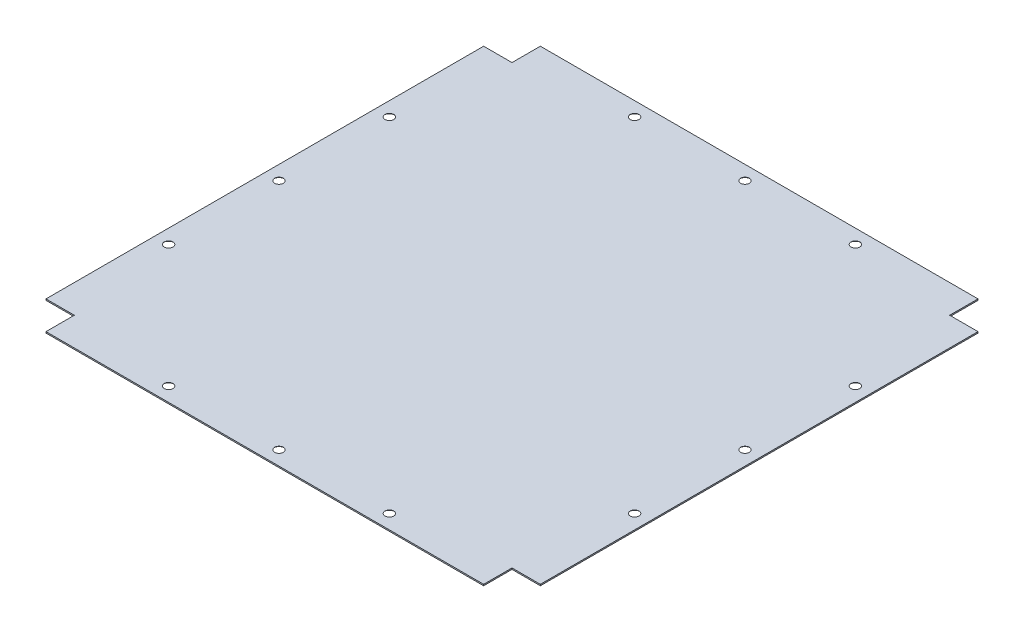
ISO-10303-21;
HEADER;
FILE_DESCRIPTION(('STEP AP214'),'2;1');
FILE_NAME('part.step','',(''),(''),'','','');
FILE_SCHEMA(('AUTOMOTIVE_DESIGN { 1 0 10303 214 1 1 1 1 }'));
ENDSEC;
DATA;
#1=APPLICATION_CONTEXT('core data for automotive mechanical design processes');
#2=APPLICATION_PROTOCOL_DEFINITION('international standard','automotive_design',2000,#1);
#3=PRODUCT_CONTEXT('',#1,'mechanical');
#4=PRODUCT('Part','Part','',(#3));
#5=PRODUCT_RELATED_PRODUCT_CATEGORY('part','',(#4));
#6=PRODUCT_DEFINITION_FORMATION('','',#4);
#7=PRODUCT_DEFINITION_CONTEXT('part definition',#1,'design');
#8=PRODUCT_DEFINITION('design','',#6,#7);
#9=PRODUCT_DEFINITION_SHAPE('','',#8);
#10=(LENGTH_UNIT() NAMED_UNIT(*) SI_UNIT(.MILLI.,.METRE.));
#11=(NAMED_UNIT(*) PLANE_ANGLE_UNIT() SI_UNIT($,.RADIAN.));
#12=(NAMED_UNIT(*) SI_UNIT($,.STERADIAN.) SOLID_ANGLE_UNIT());
#13=UNCERTAINTY_MEASURE_WITH_UNIT(LENGTH_MEASURE(1.E-05),#10,'distance_accuracy_value','');
#14=(GEOMETRIC_REPRESENTATION_CONTEXT(3) GLOBAL_UNCERTAINTY_ASSIGNED_CONTEXT((#13)) GLOBAL_UNIT_ASSIGNED_CONTEXT((#10,
#11,#12)) REPRESENTATION_CONTEXT('',''));
#15=CARTESIAN_POINT('',(0.,0.,0.));
#16=DIRECTION('',(0.,0.,1.));
#17=DIRECTION('',(1.,0.,0.));
#18=AXIS2_PLACEMENT_3D('',#15,#16,#17);
#19=CARTESIAN_POINT('',(0.,0.,0.));
#20=DIRECTION('',(0.,1.,0.));
#21=DIRECTION('',(0.,0.,1.));
#22=AXIS2_PLACEMENT_3D('',#19,#20,#21);
#23=PLANE('',#22);
#24=CARTESIAN_POINT('',(374.999999999896,0.,21.5000000000088));
#25=DIRECTION('',(0.,-1.,0.));
#26=DIRECTION('',(0.,0.,-1.));
#27=AXIS2_PLACEMENT_3D('',#24,#25,#26);
#28=CIRCLE('',#27,8.64999999999999);
#29=CARTESIAN_POINT('',(374.999999999896,0.,12.8500000000089));
#30=VERTEX_POINT('',#29);
#31=EDGE_CURVE('E564',#30,#30,#28,.T.);
#32=ORIENTED_EDGE('',*,*,#31,.F.);
#33=EDGE_LOOP('',(#32));
#34=FACE_BOUND('',#33,.T.);
#35=CARTESIAN_POINT('',(728.499999999982,0.,207.5));
#36=DIRECTION('',(0.,-1.,0.));
#37=DIRECTION('',(0.,0.,-1.));
#38=AXIS2_PLACEMENT_3D('',#35,#36,#37);
#39=CIRCLE('',#38,8.65000000000005);
#40=CARTESIAN_POINT('',(728.499999999982,0.,198.85));
#41=VERTEX_POINT('',#40);
#42=EDGE_CURVE('E226',#41,#41,#39,.T.);
#43=ORIENTED_EDGE('',*,*,#42,.F.);
#44=EDGE_LOOP('',(#43));
#45=FACE_BOUND('',#44,.T.);
#46=CARTESIAN_POINT('',(728.499999999982,0.,375.));
#47=DIRECTION('',(0.,-1.,0.));
#48=DIRECTION('',(0.,0.,-1.));
#49=AXIS2_PLACEMENT_3D('',#46,#47,#48);
#50=CIRCLE('',#49,8.65000000000005);
#51=CARTESIAN_POINT('',(728.499999999982,0.,366.35));
#52=VERTEX_POINT('',#51);
#53=EDGE_CURVE('E232',#52,#52,#50,.T.);
#54=ORIENTED_EDGE('',*,*,#53,.F.);
#55=EDGE_LOOP('',(#54));
#56=FACE_BOUND('',#55,.T.);
#57=CARTESIAN_POINT('',(374.999999999896,0.,728.499999999991));
#58=DIRECTION('',(0.,-1.,0.));
#59=DIRECTION('',(0.,0.,-1.));
#60=AXIS2_PLACEMENT_3D('',#57,#58,#59);
#61=CIRCLE('',#60,8.64999999999999);
#62=CARTESIAN_POINT('',(374.999999999896,0.,719.849999999991));
#63=VERTEX_POINT('',#62);
#64=EDGE_CURVE('E238',#63,#63,#61,.T.);
#65=ORIENTED_EDGE('',*,*,#64,.F.);
#66=EDGE_LOOP('',(#65));
#67=FACE_BOUND('',#66,.T.);
#68=CARTESIAN_POINT('',(542.499999999896,0.,728.499999999991));
#69=DIRECTION('',(0.,-1.,0.));
#70=DIRECTION('',(0.,0.,-1.));
#71=AXIS2_PLACEMENT_3D('',#68,#69,#70);
#72=CIRCLE('',#71,8.65000000000005);
#73=CARTESIAN_POINT('',(542.499999999896,0.,719.849999999991));
#74=VERTEX_POINT('',#73);
#75=EDGE_CURVE('E244',#74,#74,#72,.T.);
#76=ORIENTED_EDGE('',*,*,#75,.F.);
#77=EDGE_LOOP('',(#76));
#78=FACE_BOUND('',#77,.T.);
#79=CARTESIAN_POINT('',(207.499999999896,0.,728.499999999991));
#80=DIRECTION('',(0.,-1.,0.));
#81=DIRECTION('',(0.,0.,-1.));
#82=AXIS2_PLACEMENT_3D('',#79,#80,#81);
#83=CIRCLE('',#82,8.64999999999999);
#84=CARTESIAN_POINT('',(207.499999999896,0.,719.849999999991));
#85=VERTEX_POINT('',#84);
#86=EDGE_CURVE('E250',#85,#85,#83,.T.);
#87=ORIENTED_EDGE('',*,*,#86,.F.);
#88=EDGE_LOOP('',(#87));
#89=FACE_BOUND('',#88,.T.);
#90=CARTESIAN_POINT('',(21.5000000000184,0.,542.5));
#91=DIRECTION('',(0.,-1.,0.));
#92=DIRECTION('',(0.,0.,-1.));
#93=AXIS2_PLACEMENT_3D('',#90,#91,#92);
#94=CIRCLE('',#93,8.65);
#95=CARTESIAN_POINT('',(21.5000000000184,0.,533.85));
#96=VERTEX_POINT('',#95);
#97=EDGE_CURVE('E256',#96,#96,#94,.T.);
#98=ORIENTED_EDGE('',*,*,#97,.F.);
#99=EDGE_LOOP('',(#98));
#100=FACE_BOUND('',#99,.T.);
#101=CARTESIAN_POINT('',(21.5000000000184,0.,207.5));
#102=DIRECTION('',(0.,-1.,0.));
#103=DIRECTION('',(0.,0.,-1.));
#104=AXIS2_PLACEMENT_3D('',#101,#102,#103);
#105=CIRCLE('',#104,8.65);
#106=CARTESIAN_POINT('',(21.5000000000184,0.,198.85));
#107=VERTEX_POINT('',#106);
#108=EDGE_CURVE('E262',#107,#107,#105,.T.);
#109=ORIENTED_EDGE('',*,*,#108,.F.);
#110=EDGE_LOOP('',(#109));
#111=FACE_BOUND('',#110,.T.);
#112=CARTESIAN_POINT('',(21.5000000000184,0.,375.));
#113=DIRECTION('',(0.,-1.,0.));
#114=DIRECTION('',(0.,0.,-1.));
#115=AXIS2_PLACEMENT_3D('',#112,#113,#114);
#116=CIRCLE('',#115,8.65);
#117=CARTESIAN_POINT('',(21.5000000000184,0.,366.35));
#118=VERTEX_POINT('',#117);
#119=EDGE_CURVE('E268',#118,#118,#116,.T.);
#120=ORIENTED_EDGE('',*,*,#119,.F.);
#121=EDGE_LOOP('',(#120));
#122=FACE_BOUND('',#121,.T.);
#123=DIRECTION('',(0.,0.,-1.));
#124=VECTOR('',#123,1.);
#125=CARTESIAN_POINT('',(43.0000000000366,0.,0.));
#126=LINE('',#125,#124);
#127=CARTESIAN_POINT('',(43.0000000000369,0.,750.));
#128=VERTEX_POINT('',#127);
#129=CARTESIAN_POINT('',(43.0000000000368,0.,707.000000000001));
#130=VERTEX_POINT('',#129);
#131=EDGE_CURVE('E158',#128,#130,#126,.T.);
#132=ORIENTED_EDGE('',*,*,#131,.T.);
#133=DIRECTION('',(1.,0.,0.));
#134=VECTOR('',#133,1.);
#135=CARTESIAN_POINT('',(0.,0.,707.000000000001));
#136=LINE('',#135,#134);
#137=CARTESIAN_POINT('',(0.,0.,707.000000000001));
#138=VERTEX_POINT('',#137);
#139=EDGE_CURVE('E187',#138,#130,#136,.T.);
#140=ORIENTED_EDGE('',*,*,#139,.F.);
#141=DIRECTION('',(0.,0.,1.));
#142=VECTOR('',#141,1.);
#143=CARTESIAN_POINT('',(0.,0.,0.));
#144=LINE('',#143,#142);
#145=CARTESIAN_POINT('',(0.,0.,43.));
#146=VERTEX_POINT('',#145);
#147=EDGE_CURVE('E93',#146,#138,#144,.T.);
#148=ORIENTED_EDGE('',*,*,#147,.F.);
#149=DIRECTION('',(1.,0.,0.));
#150=VECTOR('',#149,1.);
#151=CARTESIAN_POINT('',(0.,0.,43.));
#152=LINE('',#151,#150);
#153=CARTESIAN_POINT('',(43.,0.,43.));
#154=VERTEX_POINT('',#153);
#155=EDGE_CURVE('E139',#146,#154,#152,.T.);
#156=ORIENTED_EDGE('',*,*,#155,.T.);
#157=DIRECTION('',(0.,0.,1.));
#158=VECTOR('',#157,1.);
#159=CARTESIAN_POINT('',(43.,0.,0.));
#160=LINE('',#159,#158);
#161=CARTESIAN_POINT('',(43.,0.,0.));
#162=VERTEX_POINT('',#161);
#163=EDGE_CURVE('E182',#162,#154,#160,.T.);
#164=ORIENTED_EDGE('',*,*,#163,.F.);
#165=DIRECTION('',(1.,0.,0.));
#166=VECTOR('',#165,1.);
#167=CARTESIAN_POINT('',(0.,0.,0.));
#168=LINE('',#167,#166);
#169=CARTESIAN_POINT('',(707.000000000001,0.,0.));
#170=VERTEX_POINT('',#169);
#171=EDGE_CURVE('E179',#162,#170,#168,.T.);
#172=ORIENTED_EDGE('',*,*,#171,.T.);
#173=DIRECTION('',(0.,0.,1.));
#174=VECTOR('',#173,1.);
#175=CARTESIAN_POINT('',(707.000000000001,0.,-1.82541320560462E-12));
#176=LINE('',#175,#174);
#177=CARTESIAN_POINT('',(707.000000000001,0.,42.9999999999633));
#178=VERTEX_POINT('',#177);
#179=EDGE_CURVE('E176',#170,#178,#176,.T.);
#180=ORIENTED_EDGE('',*,*,#179,.T.);
#181=DIRECTION('',(-1.,0.,0.));
#182=VECTOR('',#181,1.);
#183=CARTESIAN_POINT('',(0.,0.,42.9999999999642));
#184=LINE('',#183,#182);
#185=CARTESIAN_POINT('',(750.000000000001,0.,42.9999999999632));
#186=VERTEX_POINT('',#185);
#187=EDGE_CURVE('E173',#186,#178,#184,.T.);
#188=ORIENTED_EDGE('',*,*,#187,.F.);
#189=DIRECTION('',(0.,0.,1.));
#190=VECTOR('',#189,1.);
#191=CARTESIAN_POINT('',(750.,0.,0.));
#192=LINE('',#191,#190);
#193=CARTESIAN_POINT('',(750.,0.,706.999999999964));
#194=VERTEX_POINT('',#193);
#195=EDGE_CURVE('E170',#186,#194,#192,.T.);
#196=ORIENTED_EDGE('',*,*,#195,.T.);
#197=DIRECTION('',(-1.,0.,0.));
#198=VECTOR('',#197,1.);
#199=CARTESIAN_POINT('',(0.,0.,706.999999999964));
#200=LINE('',#199,#198);
#201=CARTESIAN_POINT('',(707.000000000038,0.,706.999999999964));
#202=VERTEX_POINT('',#201);
#203=EDGE_CURVE('E167',#194,#202,#200,.T.);
#204=ORIENTED_EDGE('',*,*,#203,.T.);
#205=DIRECTION('',(0.,0.,-1.));
#206=VECTOR('',#205,1.);
#207=CARTESIAN_POINT('',(707.000000000038,0.,0.));
#208=LINE('',#207,#206);
#209=CARTESIAN_POINT('',(707.000000000038,0.,750.));
#210=VERTEX_POINT('',#209);
#211=EDGE_CURVE('E164',#210,#202,#208,.T.);
#212=ORIENTED_EDGE('',*,*,#211,.F.);
#213=DIRECTION('',(1.,0.,0.));
#214=VECTOR('',#213,1.);
#215=CARTESIAN_POINT('',(0.,0.,750.));
#216=LINE('',#215,#214);
#217=EDGE_CURVE('E161',#128,#210,#216,.T.);
#218=ORIENTED_EDGE('',*,*,#217,.F.);
#219=EDGE_LOOP('',(#132,#140,#148,#156,#164,#172,#180,#188,#196,#204,#212,#218));
#220=FACE_BOUND('',#219,.T.);
#221=CARTESIAN_POINT('',(728.499999999982,0.,542.5));
#222=DIRECTION('',(0.,-1.,0.));
#223=DIRECTION('',(0.,0.,-1.));
#224=AXIS2_PLACEMENT_3D('',#221,#222,#223);
#225=CIRCLE('',#224,8.65000000000005);
#226=CARTESIAN_POINT('',(728.499999999982,0.,533.85));
#227=VERTEX_POINT('',#226);
#228=EDGE_CURVE('E208',#227,#227,#225,.T.);
#229=ORIENTED_EDGE('',*,*,#228,.F.);
#230=EDGE_LOOP('',(#229));
#231=FACE_BOUND('',#230,.T.);
#232=CARTESIAN_POINT('',(207.499999999896,0.,21.5000000000088));
#233=DIRECTION('',(0.,-1.,0.));
#234=DIRECTION('',(0.,0.,-1.));
#235=AXIS2_PLACEMENT_3D('',#232,#233,#234);
#236=CIRCLE('',#235,8.64999999999999);
#237=CARTESIAN_POINT('',(207.499999999896,0.,12.8500000000089));
#238=VERTEX_POINT('',#237);
#239=EDGE_CURVE('E209',#238,#238,#236,.T.);
#240=ORIENTED_EDGE('',*,*,#239,.F.);
#241=EDGE_LOOP('',(#240));
#242=FACE_BOUND('',#241,.T.);
#243=CARTESIAN_POINT('',(542.499999999896,0.,21.5000000000088));
#244=DIRECTION('',(0.,-1.,0.));
#245=DIRECTION('',(0.,0.,-1.));
#246=AXIS2_PLACEMENT_3D('',#243,#244,#245);
#247=CIRCLE('',#246,8.65000000000005);
#248=CARTESIAN_POINT('',(542.499999999896,0.,12.8500000000088));
#249=VERTEX_POINT('',#248);
#250=EDGE_CURVE('E220',#249,#249,#247,.T.);
#251=ORIENTED_EDGE('',*,*,#250,.F.);
#252=EDGE_LOOP('',(#251));
#253=FACE_BOUND('',#252,.T.);
#254=ADVANCED_FACE('F35',(#34,#45,#56,#67,#78,#89,#100,#111,#122,#220,#231,#242,#253),#23,.F.);
#255=CARTESIAN_POINT('',(0.,2.,0.));
#256=DIRECTION('',(0.,1.,0.));
#257=DIRECTION('',(0.,0.,1.));
#258=AXIS2_PLACEMENT_3D('',#255,#256,#257);
#259=PLANE('',#258);
#260=CARTESIAN_POINT('',(374.999999999896,2.,21.5000000000088));
#261=DIRECTION('',(0.,1.,0.));
#262=DIRECTION('',(0.,0.,1.));
#263=AXIS2_PLACEMENT_3D('',#260,#261,#262);
#264=CIRCLE('',#263,6.64999999999999);
#265=CARTESIAN_POINT('',(374.999999999896,2.,28.1500000000088));
#266=VERTEX_POINT('',#265);
#267=EDGE_CURVE('E562',#266,#266,#264,.T.);
#268=ORIENTED_EDGE('',*,*,#267,.F.);
#269=EDGE_LOOP('',(#268));
#270=FACE_BOUND('',#269,.T.);
#271=CARTESIAN_POINT('',(542.499999999896,2.,21.5000000000088));
#272=DIRECTION('',(0.,1.,0.));
#273=DIRECTION('',(0.,0.,1.));
#274=AXIS2_PLACEMENT_3D('',#271,#272,#273);
#275=CIRCLE('',#274,6.64999999999999);
#276=CARTESIAN_POINT('',(542.499999999896,2.,28.1500000000088));
#277=VERTEX_POINT('',#276);
#278=EDGE_CURVE('E39',#277,#277,#275,.T.);
#279=ORIENTED_EDGE('',*,*,#278,.F.);
#280=EDGE_LOOP('',(#279));
#281=FACE_BOUND('',#280,.T.);
#282=CARTESIAN_POINT('',(728.499999999982,2.,542.5));
#283=DIRECTION('',(0.,1.,0.));
#284=DIRECTION('',(0.,0.,1.));
#285=AXIS2_PLACEMENT_3D('',#282,#283,#284);
#286=CIRCLE('',#285,6.64999999999999);
#287=CARTESIAN_POINT('',(728.499999999982,2.,549.15));
#288=VERTEX_POINT('',#287);
#289=EDGE_CURVE('E213',#288,#288,#286,.T.);
#290=ORIENTED_EDGE('',*,*,#289,.F.);
#291=EDGE_LOOP('',(#290));
#292=FACE_BOUND('',#291,.T.);
#293=CARTESIAN_POINT('',(728.499999999982,2.,207.5));
#294=DIRECTION('',(0.,1.,0.));
#295=DIRECTION('',(0.,0.,1.));
#296=AXIS2_PLACEMENT_3D('',#293,#294,#295);
#297=CIRCLE('',#296,6.64999999999999);
#298=CARTESIAN_POINT('',(728.499999999982,2.,214.15));
#299=VERTEX_POINT('',#298);
#300=EDGE_CURVE('E229',#299,#299,#297,.T.);
#301=ORIENTED_EDGE('',*,*,#300,.F.);
#302=EDGE_LOOP('',(#301));
#303=FACE_BOUND('',#302,.T.);
#304=CARTESIAN_POINT('',(728.499999999982,2.,375.));
#305=DIRECTION('',(0.,1.,0.));
#306=DIRECTION('',(0.,0.,1.));
#307=AXIS2_PLACEMENT_3D('',#304,#305,#306);
#308=CIRCLE('',#307,6.64999999999999);
#309=CARTESIAN_POINT('',(728.499999999982,2.,381.65));
#310=VERTEX_POINT('',#309);
#311=EDGE_CURVE('E235',#310,#310,#308,.T.);
#312=ORIENTED_EDGE('',*,*,#311,.F.);
#313=EDGE_LOOP('',(#312));
#314=FACE_BOUND('',#313,.T.);
#315=CARTESIAN_POINT('',(374.999999999896,2.,728.499999999991));
#316=DIRECTION('',(0.,1.,0.));
#317=DIRECTION('',(0.,0.,1.));
#318=AXIS2_PLACEMENT_3D('',#315,#316,#317);
#319=CIRCLE('',#318,6.64999999999999);
#320=CARTESIAN_POINT('',(374.999999999896,2.,735.149999999991));
#321=VERTEX_POINT('',#320);
#322=EDGE_CURVE('E241',#321,#321,#319,.T.);
#323=ORIENTED_EDGE('',*,*,#322,.F.);
#324=EDGE_LOOP('',(#323));
#325=FACE_BOUND('',#324,.T.);
#326=CARTESIAN_POINT('',(542.499999999896,2.,728.499999999991));
#327=DIRECTION('',(0.,1.,0.));
#328=DIRECTION('',(0.,0.,1.));
#329=AXIS2_PLACEMENT_3D('',#326,#327,#328);
#330=CIRCLE('',#329,6.64999999999999);
#331=CARTESIAN_POINT('',(542.499999999896,2.,735.149999999991));
#332=VERTEX_POINT('',#331);
#333=EDGE_CURVE('E247',#332,#332,#330,.T.);
#334=ORIENTED_EDGE('',*,*,#333,.F.);
#335=EDGE_LOOP('',(#334));
#336=FACE_BOUND('',#335,.T.);
#337=CARTESIAN_POINT('',(207.499999999896,2.,728.499999999991));
#338=DIRECTION('',(0.,1.,0.));
#339=DIRECTION('',(0.,0.,1.));
#340=AXIS2_PLACEMENT_3D('',#337,#338,#339);
#341=CIRCLE('',#340,6.64999999999998);
#342=CARTESIAN_POINT('',(207.499999999896,2.,735.149999999991));
#343=VERTEX_POINT('',#342);
#344=EDGE_CURVE('E253',#343,#343,#341,.T.);
#345=ORIENTED_EDGE('',*,*,#344,.F.);
#346=EDGE_LOOP('',(#345));
#347=FACE_BOUND('',#346,.T.);
#348=CARTESIAN_POINT('',(21.5000000000184,2.,542.5));
#349=DIRECTION('',(0.,1.,0.));
#350=DIRECTION('',(0.,0.,1.));
#351=AXIS2_PLACEMENT_3D('',#348,#349,#350);
#352=CIRCLE('',#351,6.64999999999999);
#353=CARTESIAN_POINT('',(21.5000000000184,2.,549.15));
#354=VERTEX_POINT('',#353);
#355=EDGE_CURVE('E259',#354,#354,#352,.T.);
#356=ORIENTED_EDGE('',*,*,#355,.F.);
#357=EDGE_LOOP('',(#356));
#358=FACE_BOUND('',#357,.T.);
#359=CARTESIAN_POINT('',(21.5000000000184,2.,207.5));
#360=DIRECTION('',(0.,1.,0.));
#361=DIRECTION('',(0.,0.,1.));
#362=AXIS2_PLACEMENT_3D('',#359,#360,#361);
#363=CIRCLE('',#362,6.64999999999999);
#364=CARTESIAN_POINT('',(21.5000000000184,2.,214.15));
#365=VERTEX_POINT('',#364);
#366=EDGE_CURVE('E265',#365,#365,#363,.T.);
#367=ORIENTED_EDGE('',*,*,#366,.F.);
#368=EDGE_LOOP('',(#367));
#369=FACE_BOUND('',#368,.T.);
#370=DIRECTION('',(0.,0.,-1.));
#371=VECTOR('',#370,1.);
#372=CARTESIAN_POINT('',(43.0000000000366,2.,0.));
#373=LINE('',#372,#371);
#374=CARTESIAN_POINT('',(43.0000000000369,2.,750.));
#375=VERTEX_POINT('',#374);
#376=CARTESIAN_POINT('',(43.0000000000368,2.,707.000000000001));
#377=VERTEX_POINT('',#376);
#378=EDGE_CURVE('E189',#375,#377,#373,.T.);
#379=ORIENTED_EDGE('',*,*,#378,.F.);
#380=DIRECTION('',(1.,0.,0.));
#381=VECTOR('',#380,1.);
#382=CARTESIAN_POINT('',(0.,2.,750.));
#383=LINE('',#382,#381);
#384=CARTESIAN_POINT('',(707.000000000038,2.,750.));
#385=VERTEX_POINT('',#384);
#386=EDGE_CURVE('E274',#375,#385,#383,.T.);
#387=ORIENTED_EDGE('',*,*,#386,.T.);
#388=DIRECTION('',(0.,0.,-1.));
#389=VECTOR('',#388,1.);
#390=CARTESIAN_POINT('',(707.000000000038,2.,0.));
#391=LINE('',#390,#389);
#392=CARTESIAN_POINT('',(707.000000000038,2.,706.999999999964));
#393=VERTEX_POINT('',#392);
#394=EDGE_CURVE('E276',#385,#393,#391,.T.);
#395=ORIENTED_EDGE('',*,*,#394,.T.);
#396=DIRECTION('',(-1.,0.,0.));
#397=VECTOR('',#396,1.);
#398=CARTESIAN_POINT('',(0.,2.,706.999999999964));
#399=LINE('',#398,#397);
#400=CARTESIAN_POINT('',(750.,2.,706.999999999964));
#401=VERTEX_POINT('',#400);
#402=EDGE_CURVE('E278',#401,#393,#399,.T.);
#403=ORIENTED_EDGE('',*,*,#402,.F.);
#404=DIRECTION('',(0.,0.,1.));
#405=VECTOR('',#404,1.);
#406=CARTESIAN_POINT('',(750.,2.,0.));
#407=LINE('',#406,#405);
#408=CARTESIAN_POINT('',(750.000000000001,2.,42.9999999999632));
#409=VERTEX_POINT('',#408);
#410=EDGE_CURVE('E281',#409,#401,#407,.T.);
#411=ORIENTED_EDGE('',*,*,#410,.F.);
#412=DIRECTION('',(-1.,0.,0.));
#413=VECTOR('',#412,1.);
#414=CARTESIAN_POINT('',(0.,2.,42.9999999999642));
#415=LINE('',#414,#413);
#416=CARTESIAN_POINT('',(707.000000000001,2.,42.9999999999633));
#417=VERTEX_POINT('',#416);
#418=EDGE_CURVE('E284',#409,#417,#415,.T.);
#419=ORIENTED_EDGE('',*,*,#418,.T.);
#420=DIRECTION('',(0.,0.,1.));
#421=VECTOR('',#420,1.);
#422=CARTESIAN_POINT('',(707.000000000001,2.,-1.82541320560462E-12));
#423=LINE('',#422,#421);
#424=CARTESIAN_POINT('',(707.000000000001,2.,0.));
#425=VERTEX_POINT('',#424);
#426=EDGE_CURVE('E286',#425,#417,#423,.T.);
#427=ORIENTED_EDGE('',*,*,#426,.F.);
#428=DIRECTION('',(1.,0.,0.));
#429=VECTOR('',#428,1.);
#430=CARTESIAN_POINT('',(0.,2.,0.));
#431=LINE('',#430,#429);
#432=CARTESIAN_POINT('',(43.,2.,0.));
#433=VERTEX_POINT('',#432);
#434=EDGE_CURVE('E153',#433,#425,#431,.T.);
#435=ORIENTED_EDGE('',*,*,#434,.F.);
#436=DIRECTION('',(0.,0.,1.));
#437=VECTOR('',#436,1.);
#438=CARTESIAN_POINT('',(43.,2.,0.));
#439=LINE('',#438,#437);
#440=CARTESIAN_POINT('',(43.,2.,43.));
#441=VERTEX_POINT('',#440);
#442=EDGE_CURVE('E150',#433,#441,#439,.T.);
#443=ORIENTED_EDGE('',*,*,#442,.T.);
#444=DIRECTION('',(1.,0.,0.));
#445=VECTOR('',#444,1.);
#446=CARTESIAN_POINT('',(0.,2.,43.));
#447=LINE('',#446,#445);
#448=CARTESIAN_POINT('',(0.,2.,43.));
#449=VERTEX_POINT('',#448);
#450=EDGE_CURVE('E137',#449,#441,#447,.T.);
#451=ORIENTED_EDGE('',*,*,#450,.F.);
#452=DIRECTION('',(0.,0.,1.));
#453=VECTOR('',#452,1.);
#454=CARTESIAN_POINT('',(0.,2.,0.));
#455=LINE('',#454,#453);
#456=CARTESIAN_POINT('',(0.,2.,707.000000000001));
#457=VERTEX_POINT('',#456);
#458=EDGE_CURVE('E143',#449,#457,#455,.T.);
#459=ORIENTED_EDGE('',*,*,#458,.T.);
#460=DIRECTION('',(1.,0.,0.));
#461=VECTOR('',#460,1.);
#462=CARTESIAN_POINT('',(0.,2.,707.000000000001));
#463=LINE('',#462,#461);
#464=EDGE_CURVE('E54',#457,#377,#463,.T.);
#465=ORIENTED_EDGE('',*,*,#464,.T.);
#466=EDGE_LOOP('',(#379,#387,#395,#403,#411,#419,#427,#435,#443,#451,#459,#465));
#467=FACE_BOUND('',#466,.T.);
#468=CARTESIAN_POINT('',(21.5000000000184,2.,375.));
#469=DIRECTION('',(0.,1.,0.));
#470=DIRECTION('',(0.,0.,1.));
#471=AXIS2_PLACEMENT_3D('',#468,#469,#470);
#472=CIRCLE('',#471,6.64999999999999);
#473=CARTESIAN_POINT('',(21.5000000000184,2.,381.65));
#474=VERTEX_POINT('',#473);
#475=EDGE_CURVE('E162',#474,#474,#472,.T.);
#476=ORIENTED_EDGE('',*,*,#475,.F.);
#477=EDGE_LOOP('',(#476));
#478=FACE_BOUND('',#477,.T.);
#479=CARTESIAN_POINT('',(207.499999999896,2.,21.5000000000088));
#480=DIRECTION('',(0.,1.,0.));
#481=DIRECTION('',(0.,0.,1.));
#482=AXIS2_PLACEMENT_3D('',#479,#480,#481);
#483=CIRCLE('',#482,6.64999999999998);
#484=CARTESIAN_POINT('',(207.499999999896,2.,28.1500000000088));
#485=VERTEX_POINT('',#484);
#486=EDGE_CURVE('E206',#485,#485,#483,.T.);
#487=ORIENTED_EDGE('',*,*,#486,.F.);
#488=EDGE_LOOP('',(#487));
#489=FACE_BOUND('',#488,.T.);
#490=ADVANCED_FACE('F146',(#270,#281,#292,#303,#314,#325,#336,#347,#358,#369,#467,#478,#489),
#259,.T.);
#491=CARTESIAN_POINT('',(43.0000000000366,2.,0.));
#492=DIRECTION('',(-1.,0.,0.));
#493=DIRECTION('',(0.,0.,1.));
#494=AXIS2_PLACEMENT_3D('',#491,#492,#493);
#495=PLANE('',#494);
#496=ORIENTED_EDGE('',*,*,#131,.F.);
#497=DIRECTION('',(0.,-1.,0.));
#498=VECTOR('',#497,1.);
#499=CARTESIAN_POINT('',(43.0000000000369,2.,750.));
#500=LINE('',#499,#498);
#501=EDGE_CURVE('E11',#375,#128,#500,.T.);
#502=ORIENTED_EDGE('',*,*,#501,.F.);
#503=ORIENTED_EDGE('',*,*,#378,.T.);
#504=DIRECTION('',(0.,-1.,0.));
#505=VECTOR('',#504,1.);
#506=CARTESIAN_POINT('',(43.0000000000368,2.,707.000000000001));
#507=LINE('',#506,#505);
#508=EDGE_CURVE('E100',#377,#130,#507,.T.);
#509=ORIENTED_EDGE('',*,*,#508,.T.);
#510=EDGE_LOOP('',(#496,#502,#503,#509));
#511=FACE_BOUND('',#510,.T.);
#512=ADVANCED_FACE('F37',(#511),#495,.T.);
#513=CARTESIAN_POINT('',(0.,2.,750.));
#514=DIRECTION('',(0.,0.,-1.));
#515=DIRECTION('',(-1.,0.,0.));
#516=AXIS2_PLACEMENT_3D('',#513,#514,#515);
#517=PLANE('',#516);
#518=ORIENTED_EDGE('',*,*,#217,.T.);
#519=DIRECTION('',(0.,-1.,0.));
#520=VECTOR('',#519,1.);
#521=CARTESIAN_POINT('',(707.000000000038,2.,750.));
#522=LINE('',#521,#520);
#523=EDGE_CURVE('E45',#385,#210,#522,.T.);
#524=ORIENTED_EDGE('',*,*,#523,.F.);
#525=ORIENTED_EDGE('',*,*,#386,.F.);
#526=ORIENTED_EDGE('',*,*,#501,.T.);
#527=EDGE_LOOP('',(#518,#524,#525,#526));
#528=FACE_BOUND('',#527,.T.);
#529=ADVANCED_FACE('F525',(#528),#517,.F.);
#530=CARTESIAN_POINT('',(707.000000000038,2.,0.));
#531=DIRECTION('',(-1.,0.,0.));
#532=DIRECTION('',(0.,0.,1.));
#533=AXIS2_PLACEMENT_3D('',#530,#531,#532);
#534=PLANE('',#533);
#535=ORIENTED_EDGE('',*,*,#211,.T.);
#536=DIRECTION('',(0.,-1.,0.));
#537=VECTOR('',#536,1.);
#538=CARTESIAN_POINT('',(707.000000000038,2.,706.999999999964));
#539=LINE('',#538,#537);
#540=EDGE_CURVE('E203',#393,#202,#539,.T.);
#541=ORIENTED_EDGE('',*,*,#540,.F.);
#542=ORIENTED_EDGE('',*,*,#394,.F.);
#543=ORIENTED_EDGE('',*,*,#523,.T.);
#544=EDGE_LOOP('',(#535,#541,#542,#543));
#545=FACE_BOUND('',#544,.T.);
#546=ADVANCED_FACE('F516',(#545),#534,.F.);
#547=CARTESIAN_POINT('',(0.,2.,706.999999999964));
#548=DIRECTION('',(0.,0.,1.));
#549=DIRECTION('',(1.,0.,0.));
#550=AXIS2_PLACEMENT_3D('',#547,#548,#549);
#551=PLANE('',#550);
#552=ORIENTED_EDGE('',*,*,#203,.F.);
#553=DIRECTION('',(0.,-1.,0.));
#554=VECTOR('',#553,1.);
#555=CARTESIAN_POINT('',(750.,2.,706.999999999964));
#556=LINE('',#555,#554);
#557=EDGE_CURVE('E201',#401,#194,#556,.T.);
#558=ORIENTED_EDGE('',*,*,#557,.F.);
#559=ORIENTED_EDGE('',*,*,#402,.T.);
#560=ORIENTED_EDGE('',*,*,#540,.T.);
#561=EDGE_LOOP('',(#552,#558,#559,#560));
#562=FACE_BOUND('',#561,.T.);
#563=ADVANCED_FACE('F507',(#562),#551,.T.);
#564=CARTESIAN_POINT('',(750.,2.,0.));
#565=DIRECTION('',(1.,0.,0.));
#566=DIRECTION('',(0.,0.,-1.));
#567=AXIS2_PLACEMENT_3D('',#564,#565,#566);
#568=PLANE('',#567);
#569=ORIENTED_EDGE('',*,*,#195,.F.);
#570=DIRECTION('',(0.,-1.,0.));
#571=VECTOR('',#570,1.);
#572=CARTESIAN_POINT('',(750.000000000001,2.,42.9999999999632));
#573=LINE('',#572,#571);
#574=EDGE_CURVE('E199',#409,#186,#573,.T.);
#575=ORIENTED_EDGE('',*,*,#574,.F.);
#576=ORIENTED_EDGE('',*,*,#410,.T.);
#577=ORIENTED_EDGE('',*,*,#557,.T.);
#578=EDGE_LOOP('',(#569,#575,#576,#577));
#579=FACE_BOUND('',#578,.T.);
#580=ADVANCED_FACE('F498',(#579),#568,.T.);
#581=CARTESIAN_POINT('',(0.,2.,42.9999999999642));
#582=DIRECTION('',(0.,0.,1.));
#583=DIRECTION('',(1.,0.,0.));
#584=AXIS2_PLACEMENT_3D('',#581,#582,#583);
#585=PLANE('',#584);
#586=ORIENTED_EDGE('',*,*,#187,.T.);
#587=DIRECTION('',(0.,-1.,0.));
#588=VECTOR('',#587,1.);
#589=CARTESIAN_POINT('',(707.000000000001,2.,42.9999999999633));
#590=LINE('',#589,#588);
#591=EDGE_CURVE('E197',#417,#178,#590,.T.);
#592=ORIENTED_EDGE('',*,*,#591,.F.);
#593=ORIENTED_EDGE('',*,*,#418,.F.);
#594=ORIENTED_EDGE('',*,*,#574,.T.);
#595=EDGE_LOOP('',(#586,#592,#593,#594));
#596=FACE_BOUND('',#595,.T.);
#597=ADVANCED_FACE('F490',(#596),#585,.F.);
#598=CARTESIAN_POINT('',(707.000000000001,2.,-1.82541320560462E-12));
#599=DIRECTION('',(1.,0.,0.));
#600=DIRECTION('',(0.,0.,-1.));
#601=AXIS2_PLACEMENT_3D('',#598,#599,#600);
#602=PLANE('',#601);
#603=ORIENTED_EDGE('',*,*,#179,.F.);
#604=DIRECTION('',(0.,-1.,0.));
#605=VECTOR('',#604,1.);
#606=CARTESIAN_POINT('',(707.000000000001,2.,0.));
#607=LINE('',#606,#605);
#608=EDGE_CURVE('E195',#425,#170,#607,.T.);
#609=ORIENTED_EDGE('',*,*,#608,.F.);
#610=ORIENTED_EDGE('',*,*,#426,.T.);
#611=ORIENTED_EDGE('',*,*,#591,.T.);
#612=EDGE_LOOP('',(#603,#609,#610,#611));
#613=FACE_BOUND('',#612,.T.);
#614=ADVANCED_FACE('F298',(#613),#602,.T.);
#615=CARTESIAN_POINT('',(0.,2.,0.));
#616=DIRECTION('',(0.,0.,-1.));
#617=DIRECTION('',(-1.,0.,0.));
#618=AXIS2_PLACEMENT_3D('',#615,#616,#617);
#619=PLANE('',#618);
#620=ORIENTED_EDGE('',*,*,#171,.F.);
#621=DIRECTION('',(0.,-1.,0.));
#622=VECTOR('',#621,1.);
#623=CARTESIAN_POINT('',(43.,2.,0.));
#624=LINE('',#623,#622);
#625=EDGE_CURVE('E193',#433,#162,#624,.T.);
#626=ORIENTED_EDGE('',*,*,#625,.F.);
#627=ORIENTED_EDGE('',*,*,#434,.T.);
#628=ORIENTED_EDGE('',*,*,#608,.T.);
#629=EDGE_LOOP('',(#620,#626,#627,#628));
#630=FACE_BOUND('',#629,.T.);
#631=ADVANCED_FACE('F291',(#630),#619,.T.);
#632=CARTESIAN_POINT('',(43.,2.,0.));
#633=DIRECTION('',(1.,0.,0.));
#634=DIRECTION('',(0.,0.,-1.));
#635=AXIS2_PLACEMENT_3D('',#632,#633,#634);
#636=PLANE('',#635);
#637=ORIENTED_EDGE('',*,*,#163,.T.);
#638=DIRECTION('',(0.,-1.,0.));
#639=VECTOR('',#638,1.);
#640=CARTESIAN_POINT('',(43.,2.,43.));
#641=LINE('',#640,#639);
#642=EDGE_CURVE('E140',#441,#154,#641,.T.);
#643=ORIENTED_EDGE('',*,*,#642,.F.);
#644=ORIENTED_EDGE('',*,*,#442,.F.);
#645=ORIENTED_EDGE('',*,*,#625,.T.);
#646=EDGE_LOOP('',(#637,#643,#644,#645));
#647=FACE_BOUND('',#646,.T.);
#648=ADVANCED_FACE('F304',(#647),#636,.F.);
#649=CARTESIAN_POINT('',(0.,2.,43.));
#650=DIRECTION('',(0.,0.,-1.));
#651=DIRECTION('',(-1.,0.,0.));
#652=AXIS2_PLACEMENT_3D('',#649,#650,#651);
#653=PLANE('',#652);
#654=ORIENTED_EDGE('',*,*,#155,.F.);
#655=DIRECTION('',(0.,-1.,0.));
#656=VECTOR('',#655,1.);
#657=CARTESIAN_POINT('',(0.,2.,43.));
#658=LINE('',#657,#656);
#659=EDGE_CURVE('E133',#449,#146,#658,.T.);
#660=ORIENTED_EDGE('',*,*,#659,.F.);
#661=ORIENTED_EDGE('',*,*,#450,.T.);
#662=ORIENTED_EDGE('',*,*,#642,.T.);
#663=EDGE_LOOP('',(#654,#660,#661,#662));
#664=FACE_BOUND('',#663,.T.);
#665=ADVANCED_FACE('F135',(#664),#653,.T.);
#666=CARTESIAN_POINT('',(0.,2.,0.));
#667=DIRECTION('',(1.,0.,0.));
#668=DIRECTION('',(0.,0.,-1.));
#669=AXIS2_PLACEMENT_3D('',#666,#667,#668);
#670=PLANE('',#669);
#671=ORIENTED_EDGE('',*,*,#147,.T.);
#672=DIRECTION('',(0.,-1.,0.));
#673=VECTOR('',#672,1.);
#674=CARTESIAN_POINT('',(0.,2.,707.000000000001));
#675=LINE('',#674,#673);
#676=EDGE_CURVE('E141',#457,#138,#675,.T.);
#677=ORIENTED_EDGE('',*,*,#676,.F.);
#678=ORIENTED_EDGE('',*,*,#458,.F.);
#679=ORIENTED_EDGE('',*,*,#659,.T.);
#680=EDGE_LOOP('',(#671,#677,#678,#679));
#681=FACE_BOUND('',#680,.T.);
#682=ADVANCED_FACE('F144',(#681),#670,.F.);
#683=CARTESIAN_POINT('',(0.,2.,707.000000000001));
#684=DIRECTION('',(0.,0.,-1.));
#685=DIRECTION('',(-1.,0.,0.));
#686=AXIS2_PLACEMENT_3D('',#683,#684,#685);
#687=PLANE('',#686);
#688=ORIENTED_EDGE('',*,*,#139,.T.);
#689=ORIENTED_EDGE('',*,*,#508,.F.);
#690=ORIENTED_EDGE('',*,*,#464,.F.);
#691=ORIENTED_EDGE('',*,*,#676,.T.);
#692=EDGE_LOOP('',(#688,#689,#690,#691));
#693=FACE_BOUND('',#692,.T.);
#694=ADVANCED_FACE('F325',(#693),#687,.F.);
#695=CARTESIAN_POINT('',(21.5000000000184,0.,375.));
#696=DIRECTION('',(0.,-1.,0.));
#697=DIRECTION('',(0.,0.,-1.));
#698=AXIS2_PLACEMENT_3D('',#695,#696,#697);
#699=CONICAL_SURFACE('',#698,8.65,0.785398163397451);
#700=ORIENTED_EDGE('',*,*,#475,.T.);
#701=EDGE_LOOP('',(#700));
#702=FACE_BOUND('',#701,.T.);
#703=ORIENTED_EDGE('',*,*,#119,.T.);
#704=EDGE_LOOP('',(#703));
#705=FACE_BOUND('',#704,.T.);
#706=ADVANCED_FACE('F328',(#702,#705),#699,.F.);
#707=CARTESIAN_POINT('',(21.5000000000184,0.,207.5));
#708=DIRECTION('',(0.,-1.,0.));
#709=DIRECTION('',(0.,0.,-1.));
#710=AXIS2_PLACEMENT_3D('',#707,#708,#709);
#711=CONICAL_SURFACE('',#710,8.65,0.785398163397451);
#712=ORIENTED_EDGE('',*,*,#366,.T.);
#713=EDGE_LOOP('',(#712));
#714=FACE_BOUND('',#713,.T.);
#715=ORIENTED_EDGE('',*,*,#108,.T.);
#716=EDGE_LOOP('',(#715));
#717=FACE_BOUND('',#716,.T.);
#718=ADVANCED_FACE('F345',(#714,#717),#711,.F.);
#719=CARTESIAN_POINT('',(21.5000000000184,0.,542.5));
#720=DIRECTION('',(0.,-1.,0.));
#721=DIRECTION('',(0.,0.,-1.));
#722=AXIS2_PLACEMENT_3D('',#719,#720,#721);
#723=CONICAL_SURFACE('',#722,8.65,0.785398163397451);
#724=ORIENTED_EDGE('',*,*,#355,.T.);
#725=EDGE_LOOP('',(#724));
#726=FACE_BOUND('',#725,.T.);
#727=ORIENTED_EDGE('',*,*,#97,.T.);
#728=EDGE_LOOP('',(#727));
#729=FACE_BOUND('',#728,.T.);
#730=ADVANCED_FACE('F352',(#726,#729),#723,.F.);
#731=CARTESIAN_POINT('',(207.499999999896,0.,728.499999999991));
#732=DIRECTION('',(0.,-1.,0.));
#733=DIRECTION('',(0.,0.,-1.));
#734=AXIS2_PLACEMENT_3D('',#731,#732,#733);
#735=CONICAL_SURFACE('',#734,8.64999999999999,0.785398163397451);
#736=ORIENTED_EDGE('',*,*,#344,.T.);
#737=EDGE_LOOP('',(#736));
#738=FACE_BOUND('',#737,.T.);
#739=ORIENTED_EDGE('',*,*,#86,.T.);
#740=EDGE_LOOP('',(#739));
#741=FACE_BOUND('',#740,.T.);
#742=ADVANCED_FACE('F360',(#738,#741),#735,.F.);
#743=CARTESIAN_POINT('',(542.499999999896,0.,728.499999999991));
#744=DIRECTION('',(0.,-1.,0.));
#745=DIRECTION('',(0.,0.,-1.));
#746=AXIS2_PLACEMENT_3D('',#743,#744,#745);
#747=CONICAL_SURFACE('',#746,8.65000000000005,0.785398163397462);
#748=ORIENTED_EDGE('',*,*,#333,.T.);
#749=EDGE_LOOP('',(#748));
#750=FACE_BOUND('',#749,.T.);
#751=ORIENTED_EDGE('',*,*,#75,.T.);
#752=EDGE_LOOP('',(#751));
#753=FACE_BOUND('',#752,.T.);
#754=ADVANCED_FACE('F368',(#750,#753),#747,.F.);
#755=CARTESIAN_POINT('',(374.999999999896,0.,728.499999999991));
#756=DIRECTION('',(0.,-1.,0.));
#757=DIRECTION('',(0.,0.,-1.));
#758=AXIS2_PLACEMENT_3D('',#755,#756,#757);
#759=CONICAL_SURFACE('',#758,8.64999999999999,0.785398163397448);
#760=ORIENTED_EDGE('',*,*,#322,.T.);
#761=EDGE_LOOP('',(#760));
#762=FACE_BOUND('',#761,.T.);
#763=ORIENTED_EDGE('',*,*,#64,.T.);
#764=EDGE_LOOP('',(#763));
#765=FACE_BOUND('',#764,.T.);
#766=ADVANCED_FACE('F376',(#762,#765),#759,.F.);
#767=CARTESIAN_POINT('',(728.499999999982,0.,375.));
#768=DIRECTION('',(0.,-1.,0.));
#769=DIRECTION('',(0.,0.,-1.));
#770=AXIS2_PLACEMENT_3D('',#767,#768,#769);
#771=CONICAL_SURFACE('',#770,8.65000000000005,0.785398163397462);
#772=ORIENTED_EDGE('',*,*,#311,.T.);
#773=EDGE_LOOP('',(#772));
#774=FACE_BOUND('',#773,.T.);
#775=ORIENTED_EDGE('',*,*,#53,.T.);
#776=EDGE_LOOP('',(#775));
#777=FACE_BOUND('',#776,.T.);
#778=ADVANCED_FACE('F384',(#774,#777),#771,.F.);
#779=CARTESIAN_POINT('',(728.499999999982,0.,207.5));
#780=DIRECTION('',(0.,-1.,0.));
#781=DIRECTION('',(0.,0.,-1.));
#782=AXIS2_PLACEMENT_3D('',#779,#780,#781);
#783=CONICAL_SURFACE('',#782,8.65000000000005,0.785398163397462);
#784=ORIENTED_EDGE('',*,*,#300,.T.);
#785=EDGE_LOOP('',(#784));
#786=FACE_BOUND('',#785,.T.);
#787=ORIENTED_EDGE('',*,*,#42,.T.);
#788=EDGE_LOOP('',(#787));
#789=FACE_BOUND('',#788,.T.);
#790=ADVANCED_FACE('F392',(#786,#789),#783,.F.);
#791=CARTESIAN_POINT('',(728.499999999982,0.,542.5));
#792=DIRECTION('',(0.,-1.,0.));
#793=DIRECTION('',(0.,0.,-1.));
#794=AXIS2_PLACEMENT_3D('',#791,#792,#793);
#795=CONICAL_SURFACE('',#794,8.65000000000005,0.785398163397462);
#796=ORIENTED_EDGE('',*,*,#289,.T.);
#797=EDGE_LOOP('',(#796));
#798=FACE_BOUND('',#797,.T.);
#799=ORIENTED_EDGE('',*,*,#228,.T.);
#800=EDGE_LOOP('',(#799));
#801=FACE_BOUND('',#800,.T.);
#802=ADVANCED_FACE('F400',(#798,#801),#795,.F.);
#803=CARTESIAN_POINT('',(207.499999999896,0.,21.5000000000088));
#804=DIRECTION('',(0.,-1.,0.));
#805=DIRECTION('',(0.,0.,-1.));
#806=AXIS2_PLACEMENT_3D('',#803,#804,#805);
#807=CONICAL_SURFACE('',#806,8.64999999999999,0.785398163397451);
#808=ORIENTED_EDGE('',*,*,#486,.T.);
#809=EDGE_LOOP('',(#808));
#810=FACE_BOUND('',#809,.T.);
#811=ORIENTED_EDGE('',*,*,#239,.T.);
#812=EDGE_LOOP('',(#811));
#813=FACE_BOUND('',#812,.T.);
#814=ADVANCED_FACE('F408',(#810,#813),#807,.F.);
#815=CARTESIAN_POINT('',(542.499999999896,0.,21.5000000000088));
#816=DIRECTION('',(0.,-1.,0.));
#817=DIRECTION('',(0.,0.,-1.));
#818=AXIS2_PLACEMENT_3D('',#815,#816,#817);
#819=CONICAL_SURFACE('',#818,8.65000000000005,0.785398163397462);
#820=ORIENTED_EDGE('',*,*,#278,.T.);
#821=EDGE_LOOP('',(#820));
#822=FACE_BOUND('',#821,.T.);
#823=ORIENTED_EDGE('',*,*,#250,.T.);
#824=EDGE_LOOP('',(#823));
#825=FACE_BOUND('',#824,.T.);
#826=ADVANCED_FACE('F416',(#822,#825),#819,.F.);
#827=CARTESIAN_POINT('',(374.999999999896,0.,21.5000000000088));
#828=DIRECTION('',(0.,-1.,0.));
#829=DIRECTION('',(0.,0.,-1.));
#830=AXIS2_PLACEMENT_3D('',#827,#828,#829);
#831=CONICAL_SURFACE('',#830,8.64999999999999,0.785398163397448);
#832=ORIENTED_EDGE('',*,*,#267,.T.);
#833=EDGE_LOOP('',(#832));
#834=FACE_BOUND('',#833,.T.);
#835=ORIENTED_EDGE('',*,*,#31,.T.);
#836=EDGE_LOOP('',(#835));
#837=FACE_BOUND('',#836,.T.);
#838=ADVANCED_FACE('F424',(#834,#837),#831,.F.);
#839=CLOSED_SHELL('',(#254,#490,#512,#529,#546,#563,#580,#597,#614,#631,#648,#665,#682,#694,
#706,#718,#730,#742,#754,#766,#778,#790,#802,#814,#826,#838));
#840=MANIFOLD_SOLID_BREP('B2',#839);
#841=ADVANCED_BREP_SHAPE_REPRESENTATION('',(#18,#840),#14);
#842=SHAPE_DEFINITION_REPRESENTATION(#9,#841);
ENDSEC;
END-ISO-10303-21;
